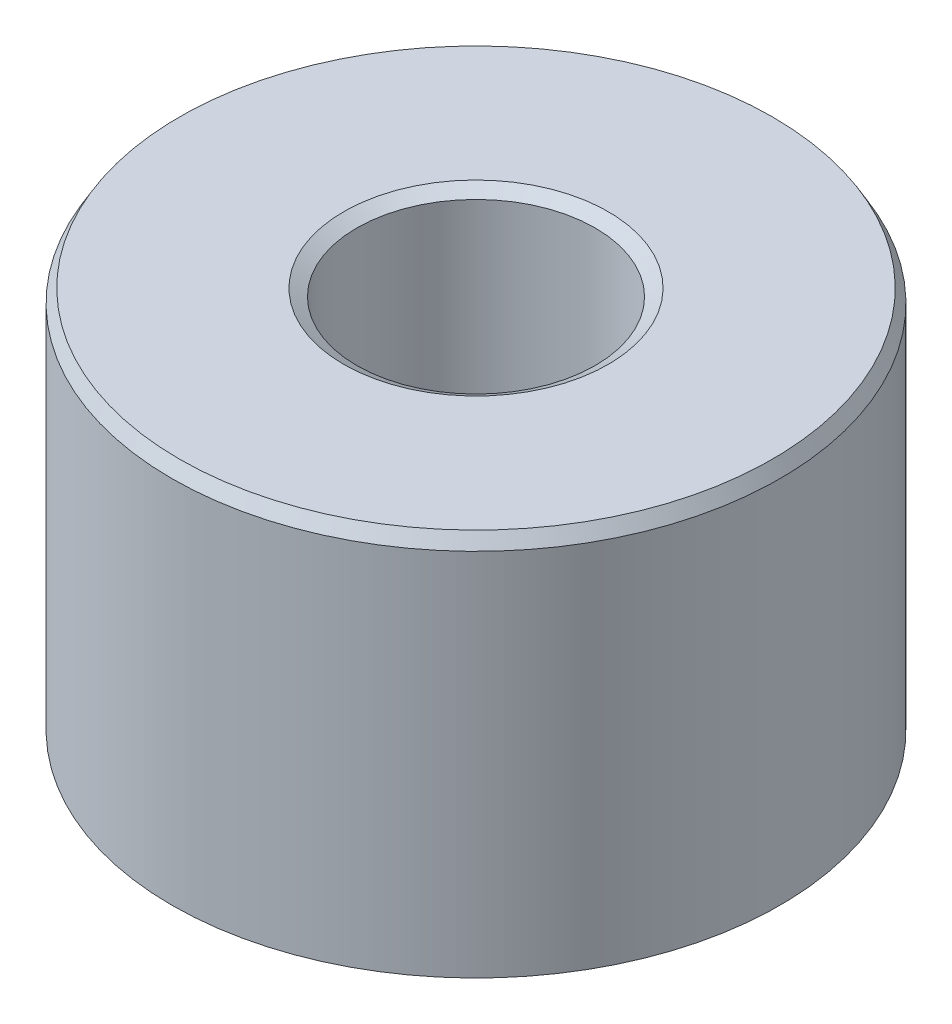
ISO-10303-21;
HEADER;
FILE_DESCRIPTION(('STEP AP214'),'2;1');
FILE_NAME('part.step','',(''),(''),'','','');
FILE_SCHEMA(('AUTOMOTIVE_DESIGN { 1 0 10303 214 1 1 1 1 }'));
ENDSEC;
DATA;
#1=APPLICATION_CONTEXT('core data for automotive mechanical design processes');
#2=APPLICATION_PROTOCOL_DEFINITION('international standard','automotive_design',2000,#1);
#3=PRODUCT_CONTEXT('',#1,'mechanical');
#4=PRODUCT('Part','Part','',(#3));
#5=PRODUCT_RELATED_PRODUCT_CATEGORY('part','',(#4));
#6=PRODUCT_DEFINITION_FORMATION('','',#4);
#7=PRODUCT_DEFINITION_CONTEXT('part definition',#1,'design');
#8=PRODUCT_DEFINITION('design','',#6,#7);
#9=PRODUCT_DEFINITION_SHAPE('','',#8);
#10=(LENGTH_UNIT() NAMED_UNIT(*) SI_UNIT(.MILLI.,.METRE.));
#11=(NAMED_UNIT(*) PLANE_ANGLE_UNIT() SI_UNIT($,.RADIAN.));
#12=(NAMED_UNIT(*) SI_UNIT($,.STERADIAN.) SOLID_ANGLE_UNIT());
#13=UNCERTAINTY_MEASURE_WITH_UNIT(LENGTH_MEASURE(1.E-05),#10,'distance_accuracy_value','');
#14=(GEOMETRIC_REPRESENTATION_CONTEXT(3) GLOBAL_UNCERTAINTY_ASSIGNED_CONTEXT((#13)) GLOBAL_UNIT_ASSIGNED_CONTEXT((#10,
#11,#12)) REPRESENTATION_CONTEXT('',''));
#15=CARTESIAN_POINT('',(0.,0.,0.));
#16=DIRECTION('',(0.,0.,1.));
#17=DIRECTION('',(1.,0.,0.));
#18=AXIS2_PLACEMENT_3D('',#15,#16,#17);
#19=CARTESIAN_POINT('',(0.,76.9966894863028,0.));
#20=DIRECTION('',(0.,-1.,0.));
#21=DIRECTION('',(0.,0.,-1.));
#22=AXIS2_PLACEMENT_3D('',#19,#20,#21);
#23=CYLINDRICAL_SURFACE('',#22,60.);
#24=CARTESIAN_POINT('',(0.,1.49172908094886,0.));
#25=DIRECTION('',(0.,1.,0.));
#26=DIRECTION('',(0.,0.,1.));
#27=AXIS2_PLACEMENT_3D('',#24,#25,#26);
#28=CIRCLE('',#27,60.);
#29=CARTESIAN_POINT('',(0.,1.49172908094884,-60.));
#30=VERTEX_POINT('',#29);
#31=EDGE_CURVE('E10',#30,#30,#28,.T.);
#32=CARTESIAN_POINT('',(0.,74.4129389269715,0.));
#33=DIRECTION('',(0.,1.,0.));
#34=DIRECTION('',(0.,0.,1.));
#35=AXIS2_PLACEMENT_3D('',#32,#33,#34);
#36=CIRCLE('',#35,60.);
#37=CARTESIAN_POINT('',(0.,74.4129389269715,-60.));
#38=VERTEX_POINT('',#37);
#39=EDGE_CURVE('E50',#38,#38,#36,.F.);
#40=CARTESIAN_POINT('',(0.,1.49172908094884,-60.));
#41=CARTESIAN_POINT('',(0.,2.25132501684491,-60.));
#42=CARTESIAN_POINT('',(0.,3.01092095274098,-60.));
#43=CARTESIAN_POINT('',(0.,4.53011282453313,-60.));
#44=CARTESIAN_POINT('',(0.,5.2897087604292,-60.));
#45=CARTESIAN_POINT('',(0.,6.80890063222133,-60.));
#46=CARTESIAN_POINT('',(0.,7.5684965681174,-60.));
#47=CARTESIAN_POINT('',(0.,9.08768843990954,-60.));
#48=CARTESIAN_POINT('',(0.,9.84728437580561,-60.));
#49=CARTESIAN_POINT('',(0.,11.3664762475977,-60.));
#50=CARTESIAN_POINT('',(0.,12.1260721834938,-60.));
#51=CARTESIAN_POINT('',(0.,13.645264055286,-60.));
#52=CARTESIAN_POINT('',(0.,14.404859991182,-60.));
#53=CARTESIAN_POINT('',(0.,15.9240518629742,-60.));
#54=CARTESIAN_POINT('',(0.,16.6836477988702,-60.));
#55=CARTESIAN_POINT('',(0.,18.2028396706624,-60.));
#56=CARTESIAN_POINT('',(0.,18.9624356065584,-60.));
#57=CARTESIAN_POINT('',(0.,20.4816274783506,-60.));
#58=CARTESIAN_POINT('',(0.,21.2412234142467,-60.));
#59=CARTESIAN_POINT('',(0.,22.7604152860388,-60.));
#60=CARTESIAN_POINT('',(0.,23.5200112219349,-60.));
#61=CARTESIAN_POINT('',(0.,25.039203093727,-60.));
#62=CARTESIAN_POINT('',(0.,25.7987990296231,-60.));
#63=CARTESIAN_POINT('',(0.,27.3179909014152,-60.));
#64=CARTESIAN_POINT('',(0.,28.0775868373113,-60.));
#65=CARTESIAN_POINT('',(0.,29.5967787091034,-60.));
#66=CARTESIAN_POINT('',(0.,30.3563746449995,-60.));
#67=CARTESIAN_POINT('',(0.,31.8755665167916,-60.));
#68=CARTESIAN_POINT('',(0.,32.6351624526877,-60.));
#69=CARTESIAN_POINT('',(0.,34.1543543244798,-60.));
#70=CARTESIAN_POINT('',(0.,34.9139502603759,-60.));
#71=CARTESIAN_POINT('',(0.,36.4331421321681,-60.));
#72=CARTESIAN_POINT('',(0.,37.1927380680641,-60.));
#73=CARTESIAN_POINT('',(0.,38.7119299398563,-60.));
#74=CARTESIAN_POINT('',(0.,39.4715258757523,-60.));
#75=CARTESIAN_POINT('',(0.,40.9907177475445,-60.));
#76=CARTESIAN_POINT('',(0.,41.7503136834405,-60.));
#77=CARTESIAN_POINT('',(0.,43.2695055552327,-60.));
#78=CARTESIAN_POINT('',(0.,44.0291014911287,-60.));
#79=CARTESIAN_POINT('',(0.,45.5482933629209,-60.));
#80=CARTESIAN_POINT('',(0.,46.307889298817,-60.));
#81=CARTESIAN_POINT('',(0.,47.8270811706091,-60.));
#82=CARTESIAN_POINT('',(0.,48.5866771065052,-60.));
#83=CARTESIAN_POINT('',(0.,50.1058689782973,-60.));
#84=CARTESIAN_POINT('',(0.,50.8654649141934,-60.));
#85=CARTESIAN_POINT('',(0.,52.3846567859855,-60.));
#86=CARTESIAN_POINT('',(0.,53.1442527218816,-60.));
#87=CARTESIAN_POINT('',(0.,54.6634445936737,-60.));
#88=CARTESIAN_POINT('',(0.,55.4230405295698,-60.));
#89=CARTESIAN_POINT('',(0.,56.9422324013619,-60.));
#90=CARTESIAN_POINT('',(0.,57.701828337258,-60.));
#91=CARTESIAN_POINT('',(0.,59.2210202090501,-60.));
#92=CARTESIAN_POINT('',(0.,59.9806161449462,-60.));
#93=CARTESIAN_POINT('',(0.,61.4998080167383,-60.));
#94=CARTESIAN_POINT('',(0.,62.2594039526344,-60.));
#95=CARTESIAN_POINT('',(0.,63.7785958244266,-60.));
#96=CARTESIAN_POINT('',(0.,64.5381917603226,-60.));
#97=CARTESIAN_POINT('',(0.,66.0573836321148,-60.));
#98=CARTESIAN_POINT('',(0.,66.8169795680109,-60.));
#99=CARTESIAN_POINT('',(0.,68.336171439803,-60.));
#100=CARTESIAN_POINT('',(0.,69.095767375699,-60.));
#101=CARTESIAN_POINT('',(0.,70.6149592474912,-60.));
#102=CARTESIAN_POINT('',(0.,71.3745551833873,-60.));
#103=CARTESIAN_POINT('',(0.,72.8937470551794,-60.));
#104=CARTESIAN_POINT('',(0.,73.6533429910755,-60.));
#105=CARTESIAN_POINT('',(0.,74.4129389269715,-60.));
#106=B_SPLINE_CURVE_WITH_KNOTS('',3,(#40,#41,#42,#43,#44,#45,#46,#47,#48,#49,#50,#51,#52,#53,
#54,#55,#56,#57,#58,#59,#60,#61,#62,#63,#64,#65,#66,#67,#68,#69,#70,#71,#72,#73,#74,#75,#76,#77,
#78,#79,#80,#81,#82,#83,#84,#85,#86,#87,#88,#89,#90,#91,#92,#93,#94,#95,#96,#97,#98,#99,#100,
#101,#102,#103,#104,#105),.UNSPECIFIED.,.F.,.F.,(4,2,2,2,2,2,2,2,2,2,2,2,2,2,2,2,2,2,2,2,2,2,2,
2,2,2,2,2,2,2,2,2,4),(0.,2.27878780768821,4.55757561537642,6.83636342306462,9.11515123075283,
11.393939038441,13.6727268461293,15.9515146538175,18.2303024615057,20.5090902691939,
22.7878780768821,25.0666658845703,27.3454536922585,29.6242414999467,31.9030293076349,
34.1818171153231,36.4606049230113,38.7393927306996,41.0181805383878,43.296968346076,
45.5757561537642,47.8545439614524,50.1333317691406,52.4121195768288,54.690907384517,
56.9696951922052,59.2484829998934,61.5272708075817,63.8060586152699,66.0848464229581,
68.3636342306463,70.6424220383345,72.9212098460227),.UNSPECIFIED.);
#107=EDGE_CURVE('BSEAM39',#30,#38,#106,.T.);
#108=ORIENTED_EDGE('',*,*,#31,.T.);
#109=ORIENTED_EDGE('',*,*,#39,.T.);
#110=ORIENTED_EDGE('',*,*,#107,.T.);
#111=ORIENTED_EDGE('',*,*,#107,.F.);
#112=EDGE_LOOP('',(#108,#110,#109,#111));
#113=FACE_BOUND('',#112,.T.);
#114=ADVANCED_FACE('F39',(#113),#23,.T.);
#115=CARTESIAN_POINT('',(0.,76.9966894863028,0.));
#116=DIRECTION('',(0.,1.,0.));
#117=DIRECTION('',(0.,0.,1.));
#118=AXIS2_PLACEMENT_3D('',#115,#116,#117);
#119=PLANE('',#118);
#120=CARTESIAN_POINT('',(0.,76.9966894863028,0.));
#121=DIRECTION('',(0.,1.,0.));
#122=DIRECTION('',(0.,0.,1.));
#123=AXIS2_PLACEMENT_3D('',#120,#121,#122);
#124=CIRCLE('',#123,26.1093819816778);
#125=CARTESIAN_POINT('',(0.,76.9966894863028,26.1093819816778));
#126=VERTEX_POINT('',#125);
#127=EDGE_CURVE('E58',#126,#126,#124,.F.);
#128=ORIENTED_EDGE('',*,*,#127,.T.);
#129=EDGE_LOOP('',(#128));
#130=FACE_BOUND('',#129,.T.);
#131=CARTESIAN_POINT('',(0.,76.9966894863028,0.));
#132=DIRECTION('',(0.,1.,0.));
#133=DIRECTION('',(0.,0.,1.));
#134=AXIS2_PLACEMENT_3D('',#131,#132,#133);
#135=CIRCLE('',#134,58.5082709190513);
#136=CARTESIAN_POINT('',(0.,76.9966894863028,58.5082709190513));
#137=VERTEX_POINT('',#136);
#138=EDGE_CURVE('E61',#137,#137,#135,.T.);
#139=ORIENTED_EDGE('',*,*,#138,.T.);
#140=EDGE_LOOP('',(#139));
#141=FACE_BOUND('',#140,.T.);
#142=ADVANCED_FACE('F88',(#130,#141),#119,.T.);
#143=CARTESIAN_POINT('',(0.,0.,0.));
#144=DIRECTION('',(0.,1.,0.));
#145=DIRECTION('',(0.,0.,1.));
#146=AXIS2_PLACEMENT_3D('',#143,#144,#145);
#147=PLANE('',#146);
#148=CARTESIAN_POINT('',(0.,0.,0.));
#149=DIRECTION('',(0.,1.,0.));
#150=DIRECTION('',(0.,0.,1.));
#151=AXIS2_PLACEMENT_3D('',#148,#149,#150);
#152=CIRCLE('',#151,25.0173605032951);
#153=CARTESIAN_POINT('',(0.,0.,25.0173605032951));
#154=VERTEX_POINT('',#153);
#155=EDGE_CURVE('E51',#154,#154,#152,.T.);
#156=ORIENTED_EDGE('',*,*,#155,.T.);
#157=EDGE_LOOP('',(#156));
#158=FACE_BOUND('',#157,.T.);
#159=CARTESIAN_POINT('',(0.,0.,0.));
#160=DIRECTION('',(0.,1.,0.));
#161=DIRECTION('',(0.,0.,1.));
#162=AXIS2_PLACEMENT_3D('',#159,#160,#161);
#163=CIRCLE('',#162,57.4162494406685);
#164=CARTESIAN_POINT('',(0.,0.,57.4162494406685));
#165=VERTEX_POINT('',#164);
#166=EDGE_CURVE('E54',#165,#165,#163,.F.);
#167=ORIENTED_EDGE('',*,*,#166,.T.);
#168=EDGE_LOOP('',(#167));
#169=FACE_BOUND('',#168,.T.);
#170=ADVANCED_FACE('F83',(#158,#169),#147,.F.);
#171=CARTESIAN_POINT('',(0.,76.9966894863028,0.));
#172=DIRECTION('',(0.,-1.,0.));
#173=DIRECTION('',(0.,0.,-1.));
#174=AXIS2_PLACEMENT_3D('',#171,#172,#173);
#175=CYLINDRICAL_SURFACE('',#174,23.5256314223463);
#176=CARTESIAN_POINT('',(0.,75.5049604053539,0.));
#177=DIRECTION('',(0.,1.,0.));
#178=DIRECTION('',(0.,0.,1.));
#179=AXIS2_PLACEMENT_3D('',#176,#177,#178);
#180=CIRCLE('',#179,23.5256314223463);
#181=CARTESIAN_POINT('',(0.,75.5049604053539,-23.5256314223463));
#182=VERTEX_POINT('',#181);
#183=EDGE_CURVE('E67',#182,#182,#180,.T.);
#184=CARTESIAN_POINT('',(0.,2.5837505593313,0.));
#185=DIRECTION('',(0.,1.,0.));
#186=DIRECTION('',(0.,0.,1.));
#187=AXIS2_PLACEMENT_3D('',#184,#185,#186);
#188=CIRCLE('',#187,23.5256314223463);
#189=CARTESIAN_POINT('',(0.,2.58375055933129,-23.5256314223463));
#190=VERTEX_POINT('',#189);
#191=EDGE_CURVE('E69',#190,#190,#188,.F.);
#192=CARTESIAN_POINT('',(0.,75.5049604053539,-23.5256314223463));
#193=CARTESIAN_POINT('',(0.,74.7453644694579,-23.5256314223463));
#194=CARTESIAN_POINT('',(0.,73.9857685335618,-23.5256314223463));
#195=CARTESIAN_POINT('',(0.,72.4665766617697,-23.5256314223463));
#196=CARTESIAN_POINT('',(0.,71.7069807258736,-23.5256314223463));
#197=CARTESIAN_POINT('',(0.,70.1877888540814,-23.5256314223463));
#198=CARTESIAN_POINT('',(0.,69.4281929181854,-23.5256314223463));
#199=CARTESIAN_POINT('',(0.,67.9090010463932,-23.5256314223463));
#200=CARTESIAN_POINT('',(0.,67.1494051104972,-23.5256314223463));
#201=CARTESIAN_POINT('',(0.,65.630213238705,-23.5256314223463));
#202=CARTESIAN_POINT('',(0.,64.870617302809,-23.5256314223463));
#203=CARTESIAN_POINT('',(0.,63.3514254310168,-23.5256314223463));
#204=CARTESIAN_POINT('',(0.,62.5918294951207,-23.5256314223463));
#205=CARTESIAN_POINT('',(0.,61.0726376233286,-23.5256314223463));
#206=CARTESIAN_POINT('',(0.,60.3130416874326,-23.5256314223463));
#207=CARTESIAN_POINT('',(0.,58.7938498156404,-23.5256314223463));
#208=CARTESIAN_POINT('',(0.,58.0342538797443,-23.5256314223463));
#209=CARTESIAN_POINT('',(0.,56.5150620079522,-23.5256314223463));
#210=CARTESIAN_POINT('',(0.,55.7554660720561,-23.5256314223463));
#211=CARTESIAN_POINT('',(0.,54.236274200264,-23.5256314223463));
#212=CARTESIAN_POINT('',(0.,53.4766782643679,-23.5256314223463));
#213=CARTESIAN_POINT('',(0.,51.9574863925758,-23.5256314223463));
#214=CARTESIAN_POINT('',(0.,51.1978904566797,-23.5256314223463));
#215=CARTESIAN_POINT('',(0.,49.6786985848876,-23.5256314223463));
#216=CARTESIAN_POINT('',(0.,48.9191026489915,-23.5256314223463));
#217=CARTESIAN_POINT('',(0.,47.3999107771994,-23.5256314223463));
#218=CARTESIAN_POINT('',(0.,46.6403148413033,-23.5256314223463));
#219=CARTESIAN_POINT('',(0.,45.1211229695112,-23.5256314223463));
#220=CARTESIAN_POINT('',(0.,44.3615270336151,-23.5256314223463));
#221=CARTESIAN_POINT('',(0.,42.842335161823,-23.5256314223463));
#222=CARTESIAN_POINT('',(0.,42.0827392259269,-23.5256314223463));
#223=CARTESIAN_POINT('',(0.,40.5635473541347,-23.5256314223463));
#224=CARTESIAN_POINT('',(0.,39.8039514182387,-23.5256314223463));
#225=CARTESIAN_POINT('',(0.,38.2847595464465,-23.5256314223463));
#226=CARTESIAN_POINT('',(0.,37.5251636105505,-23.5256314223463));
#227=CARTESIAN_POINT('',(0.,36.0059717387583,-23.5256314223463));
#228=CARTESIAN_POINT('',(0.,35.2463758028623,-23.5256314223463));
#229=CARTESIAN_POINT('',(0.,33.7271839310701,-23.5256314223463));
#230=CARTESIAN_POINT('',(0.,32.9675879951741,-23.5256314223463));
#231=CARTESIAN_POINT('',(0.,31.4483961233819,-23.5256314223463));
#232=CARTESIAN_POINT('',(0.,30.6888001874858,-23.5256314223463));
#233=CARTESIAN_POINT('',(0.,29.1696083156937,-23.5256314223463));
#234=CARTESIAN_POINT('',(0.,28.4100123797976,-23.5256314223463));
#235=CARTESIAN_POINT('',(0.,26.8908205080055,-23.5256314223463));
#236=CARTESIAN_POINT('',(0.,26.1312245721094,-23.5256314223463));
#237=CARTESIAN_POINT('',(0.,24.6120327003173,-23.5256314223463));
#238=CARTESIAN_POINT('',(0.,23.8524367644212,-23.5256314223463));
#239=CARTESIAN_POINT('',(0.,22.3332448926291,-23.5256314223463));
#240=CARTESIAN_POINT('',(0.,21.573648956733,-23.5256314223463));
#241=CARTESIAN_POINT('',(0.,20.0544570849409,-23.5256314223463));
#242=CARTESIAN_POINT('',(0.,19.2948611490448,-23.5256314223463));
#243=CARTESIAN_POINT('',(0.,17.7756692772527,-23.5256314223463));
#244=CARTESIAN_POINT('',(0.,17.0160733413566,-23.5256314223463));
#245=CARTESIAN_POINT('',(0.,15.4968814695645,-23.5256314223463));
#246=CARTESIAN_POINT('',(0.,14.7372855336684,-23.5256314223463));
#247=CARTESIAN_POINT('',(0.,13.2180936618763,-23.5256314223463));
#248=CARTESIAN_POINT('',(0.,12.4584977259802,-23.5256314223463));
#249=CARTESIAN_POINT('',(0.,10.9393058541881,-23.5256314223463));
#250=CARTESIAN_POINT('',(0.,10.179709918292,-23.5256314223463));
#251=CARTESIAN_POINT('',(0.,8.66051804649984,-23.5256314223463));
#252=CARTESIAN_POINT('',(0.,7.90092211060378,-23.5256314223463));
#253=CARTESIAN_POINT('',(0.,6.38173023881164,-23.5256314223463));
#254=CARTESIAN_POINT('',(0.,5.62213430291558,-23.5256314223463));
#255=CARTESIAN_POINT('',(0.,4.10294243112344,-23.5256314223463));
#256=CARTESIAN_POINT('',(0.,3.34334649522736,-23.5256314223463));
#257=CARTESIAN_POINT('',(0.,2.58375055933129,-23.5256314223463));
#258=B_SPLINE_CURVE_WITH_KNOTS('',3,(#192,#193,#194,#195,#196,#197,#198,#199,#200,#201,#202,
#203,#204,#205,#206,#207,#208,#209,#210,#211,#212,#213,#214,#215,#216,#217,#218,#219,#220,#221,
#222,#223,#224,#225,#226,#227,#228,#229,#230,#231,#232,#233,#234,#235,#236,#237,#238,#239,#240,
#241,#242,#243,#244,#245,#246,#247,#248,#249,#250,#251,#252,#253,#254,#255,#256,#257),
.UNSPECIFIED.,.F.,.F.,(4,2,2,2,2,2,2,2,2,2,2,2,2,2,2,2,2,2,2,2,2,2,2,2,2,2,2,2,2,2,2,2,4),(0.,
2.27878780768821,4.55757561537642,6.83636342306462,9.11515123075283,11.393939038441,
13.6727268461293,15.9515146538175,18.2303024615057,20.5090902691939,22.7878780768821,
25.0666658845703,27.3454536922585,29.6242414999467,31.9030293076349,34.1818171153231,
36.4606049230113,38.7393927306995,41.0181805383877,43.2969683460759,45.5757561537642,
47.8545439614524,50.1333317691406,52.4121195768288,54.690907384517,56.9696951922052,
59.2484829998934,61.5272708075816,63.8060586152698,66.084846422958,68.3636342306462,
70.6424220383344,72.9212098460226),.UNSPECIFIED.);
#259=EDGE_CURVE('BSEAM71',#182,#190,#258,.T.);
#260=ORIENTED_EDGE('',*,*,#183,.T.);
#261=ORIENTED_EDGE('',*,*,#191,.T.);
#262=ORIENTED_EDGE('',*,*,#259,.T.);
#263=ORIENTED_EDGE('',*,*,#259,.F.);
#264=EDGE_LOOP('',(#260,#262,#261,#263));
#265=FACE_BOUND('',#264,.T.);
#266=ADVANCED_FACE('F71',(#265),#175,.F.);
#267=CARTESIAN_POINT('',(0.,75.5049604053539,0.));
#268=DIRECTION('',(0.,1.,0.));
#269=DIRECTION('',(0.,0.,1.));
#270=AXIS2_PLACEMENT_3D('',#267,#268,#269);
#271=CONICAL_SURFACE('',#270,23.5256314223463,1.04719755119661);
#272=ORIENTED_EDGE('',*,*,#127,.F.);
#273=EDGE_LOOP('',(#272));
#274=FACE_BOUND('',#273,.T.);
#275=ORIENTED_EDGE('',*,*,#183,.F.);
#276=EDGE_LOOP('',(#275));
#277=FACE_BOUND('',#276,.T.);
#278=ADVANCED_FACE('F77',(#274,#277),#271,.F.);
#279=CARTESIAN_POINT('',(0.,0.,0.));
#280=DIRECTION('',(0.,-1.,0.));
#281=DIRECTION('',(0.,0.,-1.));
#282=AXIS2_PLACEMENT_3D('',#279,#280,#281);
#283=CONICAL_SURFACE('',#282,25.0173605032951,0.523598775598301);
#284=ORIENTED_EDGE('',*,*,#191,.F.);
#285=EDGE_LOOP('',(#284));
#286=FACE_BOUND('',#285,.T.);
#287=ORIENTED_EDGE('',*,*,#155,.F.);
#288=EDGE_LOOP('',(#287));
#289=FACE_BOUND('',#288,.T.);
#290=ADVANCED_FACE('F73',(#286,#289),#283,.F.);
#291=CARTESIAN_POINT('',(0.,1.49172908094886,0.));
#292=DIRECTION('',(0.,1.,0.));
#293=DIRECTION('',(0.,0.,1.));
#294=AXIS2_PLACEMENT_3D('',#291,#292,#293);
#295=CONICAL_SURFACE('',#294,60.,1.0471975511966);
#296=ORIENTED_EDGE('',*,*,#166,.F.);
#297=EDGE_LOOP('',(#296));
#298=FACE_BOUND('',#297,.T.);
#299=ORIENTED_EDGE('',*,*,#31,.F.);
#300=EDGE_LOOP('',(#299));
#301=FACE_BOUND('',#300,.T.);
#302=ADVANCED_FACE('F76',(#298,#301),#295,.T.);
#303=CARTESIAN_POINT('',(0.,76.9966894863028,0.));
#304=DIRECTION('',(0.,-1.,0.));
#305=DIRECTION('',(0.,0.,-1.));
#306=AXIS2_PLACEMENT_3D('',#303,#304,#305);
#307=CONICAL_SURFACE('',#306,58.5082709190513,0.523598775598293);
#308=ORIENTED_EDGE('',*,*,#39,.F.);
#309=EDGE_LOOP('',(#308));
#310=FACE_BOUND('',#309,.T.);
#311=ORIENTED_EDGE('',*,*,#138,.F.);
#312=EDGE_LOOP('',(#311));
#313=FACE_BOUND('',#312,.T.);
#314=ADVANCED_FACE('F45',(#310,#313),#307,.T.);
#315=CLOSED_SHELL('',(#114,#142,#170,#266,#278,#290,#302,#314));
#316=MANIFOLD_SOLID_BREP('B2',#315);
#317=ADVANCED_BREP_SHAPE_REPRESENTATION('',(#18,#316),#14);
#318=SHAPE_DEFINITION_REPRESENTATION(#9,#317);
ENDSEC;
END-ISO-10303-21;
